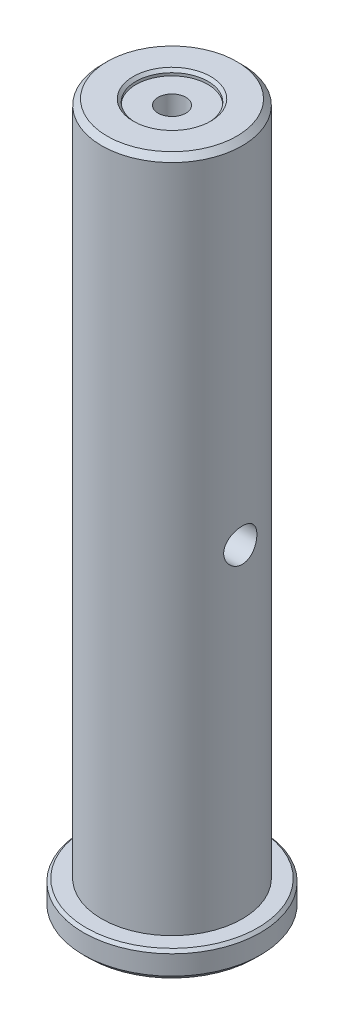
ISO-10303-21;
HEADER;
FILE_DESCRIPTION(('STEP AP214'),'2;1');
FILE_NAME('part.step','',(''),(''),'','','');
FILE_SCHEMA(('AUTOMOTIVE_DESIGN { 1 0 10303 214 1 1 1 1 }'));
ENDSEC;
DATA;
#1=APPLICATION_CONTEXT('core data for automotive mechanical design processes');
#2=APPLICATION_PROTOCOL_DEFINITION('international standard','automotive_design',2000,#1);
#3=PRODUCT_CONTEXT('',#1,'mechanical');
#4=PRODUCT('Part','Part','',(#3));
#5=PRODUCT_RELATED_PRODUCT_CATEGORY('part','',(#4));
#6=PRODUCT_DEFINITION_FORMATION('','',#4);
#7=PRODUCT_DEFINITION_CONTEXT('part definition',#1,'design');
#8=PRODUCT_DEFINITION('design','',#6,#7);
#9=PRODUCT_DEFINITION_SHAPE('','',#8);
#10=(LENGTH_UNIT() NAMED_UNIT(*) SI_UNIT(.MILLI.,.METRE.));
#11=(NAMED_UNIT(*) PLANE_ANGLE_UNIT() SI_UNIT($,.RADIAN.));
#12=(NAMED_UNIT(*) SI_UNIT($,.STERADIAN.) SOLID_ANGLE_UNIT());
#13=UNCERTAINTY_MEASURE_WITH_UNIT(LENGTH_MEASURE(1.E-05),#10,'distance_accuracy_value','');
#14=(GEOMETRIC_REPRESENTATION_CONTEXT(3) GLOBAL_UNCERTAINTY_ASSIGNED_CONTEXT((#13)) GLOBAL_UNIT_ASSIGNED_CONTEXT((#10,
#11,#12)) REPRESENTATION_CONTEXT('',''));
#15=CARTESIAN_POINT('',(0.,0.,0.));
#16=DIRECTION('',(0.,0.,1.));
#17=DIRECTION('',(1.,0.,0.));
#18=AXIS2_PLACEMENT_3D('',#15,#16,#17);
#19=CARTESIAN_POINT('',(0.,-26.0999999998717,0.));
#20=DIRECTION('',(0.,-1.,0.));
#21=DIRECTION('',(0.,0.,-1.));
#22=AXIS2_PLACEMENT_3D('',#19,#20,#21);
#23=CONICAL_SURFACE('',#22,2.49999999988404,1.02974425862171);
#24=CARTESIAN_POINT('',(0.,-24.5978484523448,5.6843418860808E-11));
#25=VERTEX_POINT('',#24);
#26=VERTEX_LOOP('',#25);
#27=FACE_BOUND('',#26,.T.);
#28=CARTESIAN_POINT('',(0.,-26.1,0.));
#29=DIRECTION('',(0.,-1.,0.));
#30=DIRECTION('',(0.,0.,-1.));
#31=AXIS2_PLACEMENT_3D('',#28,#29,#30);
#32=CIRCLE('',#31,2.5);
#33=CARTESIAN_POINT('',(0.,-26.1,-2.5));
#34=VERTEX_POINT('',#33);
#35=EDGE_CURVE('E70',#34,#34,#32,.T.);
#36=ORIENTED_EDGE('',*,*,#35,.T.);
#37=EDGE_LOOP('',(#36));
#38=FACE_BOUND('',#37,.T.);
#39=ADVANCED_FACE('F37',(#27,#38),#23,.F.);
#40=CARTESIAN_POINT('',(0.,-37.1,0.));
#41=DIRECTION('',(0.,-1.,0.));
#42=DIRECTION('',(0.,0.,-1.));
#43=AXIS2_PLACEMENT_3D('',#40,#41,#42);
#44=CYLINDRICAL_SURFACE('',#43,2.5);
#45=CARTESIAN_POINT('',(0.,-37.1,0.));
#46=DIRECTION('',(0.,-1.,0.));
#47=DIRECTION('',(0.,0.,-1.));
#48=AXIS2_PLACEMENT_3D('',#45,#46,#47);
#49=CIRCLE('',#48,2.5);
#50=CARTESIAN_POINT('',(0.,-37.1,-2.5));
#51=VERTEX_POINT('',#50);
#52=EDGE_CURVE('E96',#51,#51,#49,.T.);
#53=ORIENTED_EDGE('',*,*,#52,.T.);
#54=EDGE_LOOP('',(#53));
#55=FACE_BOUND('',#54,.T.);
#56=ORIENTED_EDGE('',*,*,#35,.F.);
#57=EDGE_LOOP('',(#56));
#58=FACE_BOUND('',#57,.T.);
#59=ADVANCED_FACE('F155',(#55,#58),#44,.F.);
#60=CARTESIAN_POINT('',(0.,-37.1,0.));
#61=DIRECTION('',(0.,1.,0.));
#62=DIRECTION('',(0.,0.,1.));
#63=AXIS2_PLACEMENT_3D('',#60,#61,#62);
#64=PLANE('',#63);
#65=CARTESIAN_POINT('',(0.,-37.1,0.));
#66=DIRECTION('',(0.,-1.,0.));
#67=DIRECTION('',(0.,0.,-1.));
#68=AXIS2_PLACEMENT_3D('',#65,#66,#67);
#69=CIRCLE('',#68,9.00000000000001);
#70=CARTESIAN_POINT('',(0.,-37.1,-9.00000000000001));
#71=VERTEX_POINT('',#70);
#72=EDGE_CURVE('E91',#71,#71,#69,.T.);
#73=ORIENTED_EDGE('',*,*,#72,.T.);
#74=EDGE_LOOP('',(#73));
#75=FACE_BOUND('',#74,.T.);
#76=ORIENTED_EDGE('',*,*,#52,.F.);
#77=EDGE_LOOP('',(#76));
#78=FACE_BOUND('',#77,.T.);
#79=ADVANCED_FACE('F162',(#75,#78),#64,.F.);
#80=CARTESIAN_POINT('',(0.,-37.6,0.));
#81=DIRECTION('',(0.,-1.,0.));
#82=DIRECTION('',(0.,0.,-1.));
#83=AXIS2_PLACEMENT_3D('',#80,#81,#82);
#84=CONICAL_SURFACE('',#83,9.50000000000001,0.78539816339745);
#85=ORIENTED_EDGE('',*,*,#72,.F.);
#86=EDGE_LOOP('',(#85));
#87=FACE_BOUND('',#86,.T.);
#88=CARTESIAN_POINT('',(0.,-37.6,0.));
#89=DIRECTION('',(0.,1.,0.));
#90=DIRECTION('',(0.,0.,1.));
#91=AXIS2_PLACEMENT_3D('',#88,#89,#90);
#92=CIRCLE('',#91,9.50000000000001);
#93=CARTESIAN_POINT('',(0.,-37.6,9.50000000000001));
#94=VERTEX_POINT('',#93);
#95=EDGE_CURVE('E87',#94,#94,#92,.F.);
#96=ORIENTED_EDGE('',*,*,#95,.T.);
#97=EDGE_LOOP('',(#96));
#98=FACE_BOUND('',#97,.T.);
#99=ADVANCED_FACE('F169',(#87,#98),#84,.F.);
#100=CARTESIAN_POINT('',(0.,26.5038387670979,0.));
#101=DIRECTION('',(0.,1.,0.));
#102=DIRECTION('',(0.,0.,1.));
#103=AXIS2_PLACEMENT_3D('',#100,#101,#102);
#104=CYLINDRICAL_SURFACE('',#103,9.50000000000001);
#105=ORIENTED_EDGE('',*,*,#95,.F.);
#106=EDGE_LOOP('',(#105));
#107=FACE_BOUND('',#106,.T.);
#108=CARTESIAN_POINT('',(0.,-38.1,0.));
#109=DIRECTION('',(0.,1.,0.));
#110=DIRECTION('',(0.,0.,1.));
#111=AXIS2_PLACEMENT_3D('',#108,#109,#110);
#112=CIRCLE('',#111,9.50000000000001);
#113=CARTESIAN_POINT('',(0.,-38.1,9.50000000000001));
#114=VERTEX_POINT('',#113);
#115=EDGE_CURVE('E90',#114,#114,#112,.F.);
#116=ORIENTED_EDGE('',*,*,#115,.T.);
#117=EDGE_LOOP('',(#116));
#118=FACE_BOUND('',#117,.T.);
#119=ADVANCED_FACE('F173',(#107,#118),#104,.F.);
#120=CARTESIAN_POINT('',(9.50000000000001,-38.1,0.));
#121=DIRECTION('',(0.,1.,0.));
#122=DIRECTION('',(0.,0.,1.));
#123=AXIS2_PLACEMENT_3D('',#120,#121,#122);
#124=PLANE('',#123);
#125=ORIENTED_EDGE('',*,*,#115,.F.);
#126=EDGE_LOOP('',(#125));
#127=FACE_BOUND('',#126,.T.);
#128=CARTESIAN_POINT('',(0.,-38.1,0.));
#129=DIRECTION('',(0.,1.,0.));
#130=DIRECTION('',(0.,0.,1.));
#131=AXIS2_PLACEMENT_3D('',#128,#129,#130);
#132=CIRCLE('',#131,15.);
#133=CARTESIAN_POINT('',(0.,-38.1,15.));
#134=VERTEX_POINT('',#133);
#135=EDGE_CURVE('E84',#134,#134,#132,.T.);
#136=ORIENTED_EDGE('',*,*,#135,.F.);
#137=EDGE_LOOP('',(#136));
#138=FACE_BOUND('',#137,.T.);
#139=ADVANCED_FACE('F176',(#127,#138),#124,.F.);
#140=CARTESIAN_POINT('',(0.,-37.1,0.));
#141=DIRECTION('',(0.,1.,0.));
#142=DIRECTION('',(0.,0.,1.));
#143=AXIS2_PLACEMENT_3D('',#140,#141,#142);
#144=CONICAL_SURFACE('',#143,16.,0.785398163397447);
#145=ORIENTED_EDGE('',*,*,#135,.T.);
#146=EDGE_LOOP('',(#145));
#147=FACE_BOUND('',#146,.T.);
#148=CARTESIAN_POINT('',(0.,-37.1,0.));
#149=DIRECTION('',(0.,1.,0.));
#150=DIRECTION('',(0.,0.,1.));
#151=AXIS2_PLACEMENT_3D('',#148,#149,#150);
#152=CIRCLE('',#151,16.);
#153=CARTESIAN_POINT('',(0.,-37.1,16.));
#154=VERTEX_POINT('',#153);
#155=EDGE_CURVE('E79',#154,#154,#152,.T.);
#156=ORIENTED_EDGE('',*,*,#155,.F.);
#157=EDGE_LOOP('',(#156));
#158=FACE_BOUND('',#157,.T.);
#159=ADVANCED_FACE('F180',(#147,#158),#144,.T.);
#160=CARTESIAN_POINT('',(0.,26.5038387670979,0.));
#161=DIRECTION('',(0.,1.,0.));
#162=DIRECTION('',(0.,0.,1.));
#163=AXIS2_PLACEMENT_3D('',#160,#161,#162);
#164=CYLINDRICAL_SURFACE('',#163,16.);
#165=ORIENTED_EDGE('',*,*,#155,.T.);
#166=EDGE_LOOP('',(#165));
#167=FACE_BOUND('',#166,.T.);
#168=CARTESIAN_POINT('',(0.,-33.6,0.));
#169=DIRECTION('',(0.,-1.,0.));
#170=DIRECTION('',(0.,0.,-1.));
#171=AXIS2_PLACEMENT_3D('',#168,#169,#170);
#172=CIRCLE('',#171,16.);
#173=CARTESIAN_POINT('',(0.,-33.6,-16.));
#174=VERTEX_POINT('',#173);
#175=EDGE_CURVE('E75',#174,#174,#172,.F.);
#176=ORIENTED_EDGE('',*,*,#175,.F.);
#177=EDGE_LOOP('',(#176));
#178=FACE_BOUND('',#177,.T.);
#179=ADVANCED_FACE('F184',(#167,#178),#164,.T.);
#180=CARTESIAN_POINT('',(0.,-33.6,0.));
#181=DIRECTION('',(0.,-1.,0.));
#182=DIRECTION('',(0.,0.,-1.));
#183=AXIS2_PLACEMENT_3D('',#180,#181,#182);
#184=CONICAL_SURFACE('',#183,16.,0.785398163397448);
#185=ORIENTED_EDGE('',*,*,#175,.T.);
#186=EDGE_LOOP('',(#185));
#187=FACE_BOUND('',#186,.T.);
#188=CARTESIAN_POINT('',(0.,-33.1,0.));
#189=DIRECTION('',(0.,-1.,0.));
#190=DIRECTION('',(0.,0.,-1.));
#191=AXIS2_PLACEMENT_3D('',#188,#189,#190);
#192=CIRCLE('',#191,15.5);
#193=CARTESIAN_POINT('',(0.,-33.1,-15.5));
#194=VERTEX_POINT('',#193);
#195=EDGE_CURVE('E78',#194,#194,#192,.T.);
#196=ORIENTED_EDGE('',*,*,#195,.T.);
#197=EDGE_LOOP('',(#196));
#198=FACE_BOUND('',#197,.T.);
#199=ADVANCED_FACE('F188',(#187,#198),#184,.T.);
#200=CARTESIAN_POINT('',(15.5,-33.1,0.));
#201=DIRECTION('',(0.,-1.,0.));
#202=DIRECTION('',(0.,0.,-1.));
#203=AXIS2_PLACEMENT_3D('',#200,#201,#202);
#204=PLANE('',#203);
#205=ORIENTED_EDGE('',*,*,#195,.F.);
#206=EDGE_LOOP('',(#205));
#207=FACE_BOUND('',#206,.T.);
#208=CARTESIAN_POINT('',(0.,-33.1,0.));
#209=DIRECTION('',(0.,1.,0.));
#210=DIRECTION('',(0.,0.,1.));
#211=AXIS2_PLACEMENT_3D('',#208,#209,#210);
#212=CIRCLE('',#211,12.7);
#213=CARTESIAN_POINT('',(0.,-33.1,12.7));
#214=VERTEX_POINT('',#213);
#215=EDGE_CURVE('E99',#214,#214,#212,.T.);
#216=ORIENTED_EDGE('',*,*,#215,.F.);
#217=EDGE_LOOP('',(#216));
#218=FACE_BOUND('',#217,.T.);
#219=ADVANCED_FACE('F151',(#207,#218),#204,.F.);
#220=CARTESIAN_POINT('',(0.,26.5038387670979,0.));
#221=DIRECTION('',(0.,1.,0.));
#222=DIRECTION('',(0.,0.,1.));
#223=AXIS2_PLACEMENT_3D('',#220,#221,#222);
#224=CYLINDRICAL_SURFACE('',#223,12.7);
#225=CARTESIAN_POINT('',(-12.3405834546021,25.4,-3.00000000000001));
#226=CARTESIAN_POINT('',(-12.3405867552515,25.2340309742241,-2.9999947986192));
#227=CARTESIAN_POINT('',(-12.3439681639376,25.0680022234936,-2.98618025270879));
#228=CARTESIAN_POINT('',(-12.3570983771738,24.7406913937602,-2.93136245477037));
#229=CARTESIAN_POINT('',(-12.3668512939366,24.5794124506168,-2.8903416433815));
#230=CARTESIAN_POINT('',(-12.3915597141969,24.2663829455557,-2.78249577795816));
#231=CARTESIAN_POINT('',(-12.406508961645,24.1146211837446,-2.71570174263797));
#232=CARTESIAN_POINT('',(-12.439917980932,23.8244468335215,-2.5582975169812));
#233=CARTESIAN_POINT('',(-12.4583778022552,23.6860344333204,-2.46768699092613));
#234=CARTESIAN_POINT('',(-12.4971341157553,23.4237648667291,-2.26332000863187));
#235=CARTESIAN_POINT('',(-12.5174573393053,23.3002087828986,-2.14918216282701));
#236=CARTESIAN_POINT('',(-12.5574177003081,23.0738045192715,-1.90182286693526));
#237=CARTESIAN_POINT('',(-12.5770547786081,22.9709581212415,-1.76859977652745));
#238=CARTESIAN_POINT('',(-12.6137239719163,22.7876793742958,-1.48480893314835));
#239=CARTESIAN_POINT('',(-12.6307208615053,22.7075400019444,-1.33404702472816));
#240=CARTESIAN_POINT('',(-12.6598909936041,22.5738507536394,-1.02072515323631));
#241=CARTESIAN_POINT('',(-12.6720648694535,22.5202973862805,-0.858166742555066));
#242=CARTESIAN_POINT('',(-12.6900283681532,22.4422568078228,-0.529001629765295));
#243=CARTESIAN_POINT('',(-12.6959299939122,22.4172590529449,-0.362522187479545));
#244=CARTESIAN_POINT('',(-12.7010733204737,22.3954396059966,-0.0276350287817193));
#245=CARTESIAN_POINT('',(-12.7003159043761,22.398614177807,0.140772428985132));
#246=CARTESIAN_POINT('',(-12.6923108785029,22.4326761149572,0.471204028849365));
#247=CARTESIAN_POINT('',(-12.685192248261,22.4630127677274,0.633288530270396));
#248=CARTESIAN_POINT('',(-12.6654133212508,22.5496560047824,0.949998324283782));
#249=CARTESIAN_POINT('',(-12.652752748352,22.6059638831058,1.10462324477203));
#250=CARTESIAN_POINT('',(-12.6231105369077,22.7434155280563,1.40351094180073));
#251=CARTESIAN_POINT('',(-12.6060939900068,22.8247610633708,1.54767732548809));
#252=CARTESIAN_POINT('',(-12.569594968861,23.0098271166194,1.82050994076874));
#253=CARTESIAN_POINT('',(-12.5501121075764,23.1135511482231,1.94917373333533));
#254=CARTESIAN_POINT('',(-12.5102557426675,23.3434035197155,2.19062975846301));
#255=CARTESIAN_POINT('',(-12.4898720962147,23.470013554354,2.30296222384418));
#256=CARTESIAN_POINT('',(-12.4509479008397,23.7404875791052,2.5048957074095));
#257=CARTESIAN_POINT('',(-12.4324074202314,23.8843522082947,2.59449588325036));
#258=CARTESIAN_POINT('',(-12.3992364452359,24.1860805887778,2.74867389435204));
#259=CARTESIAN_POINT('',(-12.3846216061614,24.3439971432482,2.81315199075165));
#260=CARTESIAN_POINT('',(-12.361163891032,24.6688543435126,2.91450898004239));
#261=CARTESIAN_POINT('',(-12.3523199281954,24.8357932837791,2.95139306967752));
#262=CARTESIAN_POINT('',(-12.3416305703028,25.1697211574721,2.99577506689081));
#263=CARTESIAN_POINT('',(-12.3396244346744,25.3366153291514,3.0039480461921));
#264=CARTESIAN_POINT('',(-12.3424021208832,25.6693819763325,2.99251467034554));
#265=CARTESIAN_POINT('',(-12.3471853912633,25.8352545337141,2.97291057134052));
#266=CARTESIAN_POINT('',(-12.3628499077692,26.1588346439623,2.90706871465484));
#267=CARTESIAN_POINT('',(-12.37364334047,26.3166248358406,2.86121423179316));
#268=CARTESIAN_POINT('',(-12.4000305578142,26.6222810505835,2.74459361459814));
#269=CARTESIAN_POINT('',(-12.4156248628205,26.7701459955406,2.67382477969691));
#270=CARTESIAN_POINT('',(-12.4502018670966,27.0546426079838,2.50793769135439));
#271=CARTESIAN_POINT('',(-12.4692397057665,27.1910288293784,2.41241023649746));
#272=CARTESIAN_POINT('',(-12.508418891342,27.4460832351942,2.20024312204814));
#273=CARTESIAN_POINT('',(-12.5285603989996,27.5647488291373,2.08360038123467));
#274=CARTESIAN_POINT('',(-12.5682154806913,27.7836757565837,1.8294351289871));
#275=CARTESIAN_POINT('',(-12.5877053868826,27.8834731277362,1.69150862917181));
#276=CARTESIAN_POINT('',(-12.6233979717533,28.0584849186101,1.40045958706062));
#277=CARTESIAN_POINT('',(-12.6396008155023,28.1337005728922,1.24733780841667));
#278=CARTESIAN_POINT('',(-12.6667953232137,28.2567989973915,0.931266340092585));
#279=CARTESIAN_POINT('',(-12.6778226529874,28.3048693146483,0.768392904306745));
#280=CARTESIAN_POINT('',(-12.6935789726756,28.372887097615,0.436588241550898));
#281=CARTESIAN_POINT('',(-12.6983090399519,28.3928393739101,0.267658055874661));
#282=CARTESIAN_POINT('',(-12.7008993537832,28.4038086341681,-0.0670858950952647));
#283=CARTESIAN_POINT('',(-12.698922999739,28.3955138298096,-0.232876206526183));
#284=CARTESIAN_POINT('',(-12.6886792846242,28.3517838547065,-0.560628835557882));
#285=CARTESIAN_POINT('',(-12.6804120752351,28.3163493383389,-0.722591245357753));
#286=CARTESIAN_POINT('',(-12.6585349476798,28.219697769664,-1.03745535327697));
#287=CARTESIAN_POINT('',(-12.6449483253229,28.158593053244,-1.19039325739078));
#288=CARTESIAN_POINT('',(-12.6138718519278,28.0124400630194,-1.48392969727621));
#289=CARTESIAN_POINT('',(-12.5963815576374,27.927389069888,-1.62452682925617));
#290=CARTESIAN_POINT('',(-12.5589188788385,27.7335926487413,-1.89269784116764));
#291=CARTESIAN_POINT('',(-12.538900801949,27.624372322815,-2.01992216623952));
#292=CARTESIAN_POINT('',(-12.498861896439,27.3862761933158,-2.2544712498921));
#293=CARTESIAN_POINT('',(-12.4788410683609,27.257395538937,-2.36179108290443));
#294=CARTESIAN_POINT('',(-12.4406982518011,26.9811279693928,-2.55517580989632));
#295=CARTESIAN_POINT('',(-12.4226122154044,26.8334754329365,-2.64086882423843));
#296=CARTESIAN_POINT('',(-12.3908548561017,26.5254595481595,-2.78608721227338));
#297=CARTESIAN_POINT('',(-12.377180079871,26.3651062656254,-2.84563306834565));
#298=CARTESIAN_POINT('',(-12.3581116997091,26.0706830677178,-2.92718665623947));
#299=CARTESIAN_POINT('',(-12.3515853338036,25.9381136225664,-2.95443550510606));
#300=CARTESIAN_POINT('',(-12.3428200100531,25.6703758812206,-2.99084369124859));
#301=CARTESIAN_POINT('',(-12.3405807657064,25.5352077593017,-3.00000423733911));
#302=CARTESIAN_POINT('',(-12.3405834546021,25.4,-3.00000000000001));
#303=B_SPLINE_CURVE_WITH_KNOTS('',3,(#225,#226,#227,#228,#229,#230,#231,#232,#233,#234,#235,
#236,#237,#238,#239,#240,#241,#242,#243,#244,#245,#246,#247,#248,#249,#250,#251,#252,#253,#254,
#255,#256,#257,#258,#259,#260,#261,#262,#263,#264,#265,#266,#267,#268,#269,#270,#271,#272,#273,
#274,#275,#276,#277,#278,#279,#280,#281,#282,#283,#284,#285,#286,#287,#288,#289,#290,#291,#292,
#293,#294,#295,#296,#297,#298,#299,#300,#301,#302),.UNSPECIFIED.,.T.,.F.,(4,2,2,2,2,2,2,2,2,2,2,
2,2,2,2,2,2,2,2,2,2,2,2,2,2,2,2,2,2,2,2,2,2,2,2,2,2,2,4),(0.,0.497411026443941,
0.995143402777372,1.49227860492331,1.98942081508859,2.49536478555058,3.00135226653359,
3.51359835731242,4.02577715959639,4.52864792978655,5.03145201194261,5.52428694235285,
6.01714643133854,6.51408654761747,7.01110474580709,7.52015808792639,8.02923029022512,
8.54030348656796,9.05128040890335,9.55015944231039,10.048997957495,10.5407323472655,
11.0325200545446,11.5330211371553,12.0335953137055,12.5452167410731,13.0568124694697,
13.5648289273917,14.0727584605778,14.568402228839,15.0640340468005,15.5575191492549,
16.0510603142398,16.555330529637,17.0597253658004,17.5722788464447,18.0844300988553,
18.4896763485681,18.8948955153554),.UNSPECIFIED.);
#304=CARTESIAN_POINT('',(-12.3405834546021,25.4,-3.00000000000001));
#305=VERTEX_POINT('',#304);
#306=EDGE_CURVE('E41',#305,#305,#303,.T.);
#307=ORIENTED_EDGE('',*,*,#306,.F.);
#308=EDGE_LOOP('',(#307));
#309=FACE_BOUND('',#308,.T.);
#310=CARTESIAN_POINT('',(12.3405834546021,25.4,-3.00000000000001));
#311=CARTESIAN_POINT('',(12.3405867552515,25.5659690257759,-2.9999947986192));
#312=CARTESIAN_POINT('',(12.3439681639376,25.7319977765064,-2.98618025270879));
#313=CARTESIAN_POINT('',(12.3570983771738,26.0593086062398,-2.93136245477037));
#314=CARTESIAN_POINT('',(12.3668512939366,26.2205875493833,-2.8903416433815));
#315=CARTESIAN_POINT('',(12.3915597141969,26.5336170544443,-2.78249577795816));
#316=CARTESIAN_POINT('',(12.406508961645,26.6853788162555,-2.71570174263797));
#317=CARTESIAN_POINT('',(12.439917980932,26.9755531664785,-2.5582975169812));
#318=CARTESIAN_POINT('',(12.4583778022552,27.1139655666796,-2.46768699092613));
#319=CARTESIAN_POINT('',(12.4971341157553,27.3762351332709,-2.26332000863187));
#320=CARTESIAN_POINT('',(12.5174573393053,27.4997912171014,-2.14918216282701));
#321=CARTESIAN_POINT('',(12.5574177003081,27.7261954807285,-1.90182286693526));
#322=CARTESIAN_POINT('',(12.5770547786081,27.8290418787585,-1.76859977652745));
#323=CARTESIAN_POINT('',(12.6137239719163,28.0123206257042,-1.48480893314835));
#324=CARTESIAN_POINT('',(12.6307208615053,28.0924599980557,-1.33404702472816));
#325=CARTESIAN_POINT('',(12.6598909936041,28.2261492463606,-1.02072515323631));
#326=CARTESIAN_POINT('',(12.6720648694535,28.2797026137196,-0.858166742555066));
#327=CARTESIAN_POINT('',(12.6900283681532,28.3577431921772,-0.529001629765295));
#328=CARTESIAN_POINT('',(12.6959299939122,28.3827409470551,-0.362522187479545));
#329=CARTESIAN_POINT('',(12.7010733204737,28.4045603940034,-0.0276350287817193));
#330=CARTESIAN_POINT('',(12.7003159043761,28.4013858221931,0.140772428985132));
#331=CARTESIAN_POINT('',(12.6923108785029,28.3673238850428,0.471204028849365));
#332=CARTESIAN_POINT('',(12.685192248261,28.3369872322726,0.633288530270397));
#333=CARTESIAN_POINT('',(12.6654133212508,28.2503439952176,0.949998324283783));
#334=CARTESIAN_POINT('',(12.652752748352,28.1940361168942,1.10462324477204));
#335=CARTESIAN_POINT('',(12.6231105369077,28.0565844719438,1.40351094180073));
#336=CARTESIAN_POINT('',(12.6060939900068,27.9752389366292,1.54767732548809));
#337=CARTESIAN_POINT('',(12.569594968861,27.7901728833806,1.82050994076874));
#338=CARTESIAN_POINT('',(12.5501121075764,27.6864488517769,1.94917373333533));
#339=CARTESIAN_POINT('',(12.5102557426675,27.4565964802845,2.19062975846301));
#340=CARTESIAN_POINT('',(12.4898720962147,27.329986445646,2.30296222384418));
#341=CARTESIAN_POINT('',(12.4509479008397,27.0595124208948,2.5048957074095));
#342=CARTESIAN_POINT('',(12.4324074202314,26.9156477917053,2.59449588325036));
#343=CARTESIAN_POINT('',(12.3992364452359,26.6139194112222,2.74867389435204));
#344=CARTESIAN_POINT('',(12.3846216061614,26.4560028567518,2.81315199075165));
#345=CARTESIAN_POINT('',(12.361163891032,26.1311456564874,2.91450898004239));
#346=CARTESIAN_POINT('',(12.3523199281954,25.9642067162209,2.95139306967752));
#347=CARTESIAN_POINT('',(12.3416305703028,25.6302788425279,2.99577506689081));
#348=CARTESIAN_POINT('',(12.3396244346744,25.4633846708486,3.0039480461921));
#349=CARTESIAN_POINT('',(12.3424021208832,25.1306180236675,2.99251467034554));
#350=CARTESIAN_POINT('',(12.3471853912633,24.9647454662859,2.97291057134052));
#351=CARTESIAN_POINT('',(12.3628499077692,24.6411653560378,2.90706871465484));
#352=CARTESIAN_POINT('',(12.37364334047,24.4833751641594,2.86121423179317));
#353=CARTESIAN_POINT('',(12.4000305578142,24.1777189494165,2.74459361459814));
#354=CARTESIAN_POINT('',(12.4156248628205,24.0298540044594,2.67382477969691));
#355=CARTESIAN_POINT('',(12.4502018670966,23.7453573920163,2.50793769135439));
#356=CARTESIAN_POINT('',(12.4692397057665,23.6089711706216,2.41241023649746));
#357=CARTESIAN_POINT('',(12.508418891342,23.3539167648058,2.20024312204814));
#358=CARTESIAN_POINT('',(12.5285603989996,23.2352511708627,2.08360038123467));
#359=CARTESIAN_POINT('',(12.5682154806913,23.0163242434163,1.8294351289871));
#360=CARTESIAN_POINT('',(12.5877053868826,22.9165268722638,1.69150862917181));
#361=CARTESIAN_POINT('',(12.6233979717533,22.7415150813899,1.40045958706062));
#362=CARTESIAN_POINT('',(12.6396008155023,22.6662994271078,1.24733780841667));
#363=CARTESIAN_POINT('',(12.6667953232137,22.5432010026085,0.931266340092585));
#364=CARTESIAN_POINT('',(12.6778226529874,22.4951306853517,0.768392904306745));
#365=CARTESIAN_POINT('',(12.6935789726756,22.427112902385,0.436588241550898));
#366=CARTESIAN_POINT('',(12.6983090399519,22.40716062609,0.267658055874661));
#367=CARTESIAN_POINT('',(12.7008993537832,22.3961913658319,-0.0670858950952647));
#368=CARTESIAN_POINT('',(12.698922999739,22.4044861701904,-0.232876206526183));
#369=CARTESIAN_POINT('',(12.6886792846242,22.4482161452935,-0.560628835557882));
#370=CARTESIAN_POINT('',(12.6804120752351,22.4836506616611,-0.722591245357753));
#371=CARTESIAN_POINT('',(12.6585349476798,22.580302230336,-1.03745535327697));
#372=CARTESIAN_POINT('',(12.6449483253229,22.641406946756,-1.19039325739078));
#373=CARTESIAN_POINT('',(12.6138718519278,22.7875599369806,-1.48392969727621));
#374=CARTESIAN_POINT('',(12.5963815576374,22.872610930112,-1.62452682925617));
#375=CARTESIAN_POINT('',(12.5589188788385,23.0664073512587,-1.89269784116764));
#376=CARTESIAN_POINT('',(12.538900801949,23.175627677185,-2.01992216623952));
#377=CARTESIAN_POINT('',(12.498861896439,23.4137238066842,-2.2544712498921));
#378=CARTESIAN_POINT('',(12.4788410683609,23.542604461063,-2.36179108290443));
#379=CARTESIAN_POINT('',(12.4406982518011,23.8188720306072,-2.55517580989632));
#380=CARTESIAN_POINT('',(12.4226122154044,23.9665245670635,-2.64086882423843));
#381=CARTESIAN_POINT('',(12.3908548561017,24.2745404518405,-2.78608721227338));
#382=CARTESIAN_POINT('',(12.377180079871,24.4348937343746,-2.84563306834565));
#383=CARTESIAN_POINT('',(12.3581116997091,24.7293169322822,-2.92718665623947));
#384=CARTESIAN_POINT('',(12.3515853338036,24.8618863774336,-2.95443550510605));
#385=CARTESIAN_POINT('',(12.3428200100531,25.1296241187794,-2.99084369124859));
#386=CARTESIAN_POINT('',(12.3405807657064,25.2647922406983,-3.00000423733911));
#387=CARTESIAN_POINT('',(12.3405834546021,25.4,-3.00000000000001));
#388=B_SPLINE_CURVE_WITH_KNOTS('',3,(#310,#311,#312,#313,#314,#315,#316,#317,#318,#319,#320,
#321,#322,#323,#324,#325,#326,#327,#328,#329,#330,#331,#332,#333,#334,#335,#336,#337,#338,#339,
#340,#341,#342,#343,#344,#345,#346,#347,#348,#349,#350,#351,#352,#353,#354,#355,#356,#357,#358,
#359,#360,#361,#362,#363,#364,#365,#366,#367,#368,#369,#370,#371,#372,#373,#374,#375,#376,#377,
#378,#379,#380,#381,#382,#383,#384,#385,#386,#387),.UNSPECIFIED.,.T.,.F.,(4,2,2,2,2,2,2,2,2,2,2,
2,2,2,2,2,2,2,2,2,2,2,2,2,2,2,2,2,2,2,2,2,2,2,2,2,2,2,4),(0.,0.497411026443941,
0.995143402777372,1.4922786049233,1.98942081508859,2.49536478555058,3.00135226653359,
3.51359835731242,4.02577715959639,4.52864792978655,5.03145201194261,5.52428694235286,
6.01714643133854,6.51408654761747,7.01110474580709,7.52015808792639,8.02923029022512,
8.54030348656797,9.05128040890335,9.55015944231039,10.048997957495,10.5407323472655,
11.0325200545446,11.5330211371553,12.0335953137055,12.5452167410731,13.0568124694697,
13.5648289273917,14.0727584605778,14.568402228839,15.0640340468005,15.5575191492549,
16.0510603142398,16.555330529637,17.0597253658004,17.5722788464447,18.0844300988553,
18.4896763485681,18.8948955153554),.UNSPECIFIED.);
#389=CARTESIAN_POINT('',(12.3405834546021,25.4,-3.00000000000001));
#390=VERTEX_POINT('',#389);
#391=EDGE_CURVE('E119',#390,#390,#388,.T.);
#392=ORIENTED_EDGE('',*,*,#391,.F.);
#393=EDGE_LOOP('',(#392));
#394=FACE_BOUND('',#393,.T.);
#395=CARTESIAN_POINT('',(0.,87.9,0.));
#396=DIRECTION('',(0.,1.,0.));
#397=DIRECTION('',(0.,0.,1.));
#398=AXIS2_PLACEMENT_3D('',#395,#396,#397);
#399=CIRCLE('',#398,12.7);
#400=CARTESIAN_POINT('',(0.,87.9,12.7));
#401=VERTEX_POINT('',#400);
#402=EDGE_CURVE('E115',#401,#401,#399,.F.);
#403=ORIENTED_EDGE('',*,*,#402,.T.);
#404=EDGE_LOOP('',(#403));
#405=FACE_BOUND('',#404,.T.);
#406=ORIENTED_EDGE('',*,*,#215,.T.);
#407=EDGE_LOOP('',(#406));
#408=FACE_BOUND('',#407,.T.);
#409=ADVANCED_FACE('F123',(#309,#394,#405,#408),#224,.T.);
#410=CARTESIAN_POINT('',(0.,88.9,0.));
#411=DIRECTION('',(0.,1.,0.));
#412=DIRECTION('',(0.,0.,1.));
#413=AXIS2_PLACEMENT_3D('',#410,#411,#412);
#414=PLANE('',#413);
#415=CARTESIAN_POINT('',(0.,88.9,0.));
#416=DIRECTION('',(0.,1.,0.));
#417=DIRECTION('',(0.,0.,1.));
#418=AXIS2_PLACEMENT_3D('',#415,#416,#417);
#419=CIRCLE('',#418,7.00000000000002);
#420=CARTESIAN_POINT('',(0.,88.9,7.00000000000002));
#421=VERTEX_POINT('',#420);
#422=EDGE_CURVE('E11',#421,#421,#419,.F.);
#423=ORIENTED_EDGE('',*,*,#422,.T.);
#424=EDGE_LOOP('',(#423));
#425=FACE_BOUND('',#424,.T.);
#426=CARTESIAN_POINT('',(0.,88.9,0.));
#427=DIRECTION('',(0.,1.,0.));
#428=DIRECTION('',(0.,0.,1.));
#429=AXIS2_PLACEMENT_3D('',#426,#427,#428);
#430=CIRCLE('',#429,11.7);
#431=CARTESIAN_POINT('',(0.,88.9,11.7));
#432=VERTEX_POINT('',#431);
#433=EDGE_CURVE('E102',#432,#432,#430,.T.);
#434=ORIENTED_EDGE('',*,*,#433,.T.);
#435=EDGE_LOOP('',(#434));
#436=FACE_BOUND('',#435,.T.);
#437=ADVANCED_FACE('F143',(#425,#436),#414,.T.);
#438=CARTESIAN_POINT('',(0.,88.9,0.));
#439=DIRECTION('',(0.,-1.,0.));
#440=DIRECTION('',(0.,0.,-1.));
#441=AXIS2_PLACEMENT_3D('',#438,#439,#440);
#442=CONICAL_SURFACE('',#441,11.7,0.785398163397451);
#443=ORIENTED_EDGE('',*,*,#402,.F.);
#444=EDGE_LOOP('',(#443));
#445=FACE_BOUND('',#444,.T.);
#446=ORIENTED_EDGE('',*,*,#433,.F.);
#447=EDGE_LOOP('',(#446));
#448=FACE_BOUND('',#447,.T.);
#449=ADVANCED_FACE('F141',(#445,#448),#442,.T.);
#450=CARTESIAN_POINT('',(0.,87.9,0.));
#451=DIRECTION('',(0.,1.,0.));
#452=DIRECTION('',(0.,0.,1.));
#453=AXIS2_PLACEMENT_3D('',#450,#451,#452);
#454=CYLINDRICAL_SURFACE('',#453,6.5);
#455=CARTESIAN_POINT('',(0.,88.4,0.));
#456=DIRECTION('',(0.,1.,0.));
#457=DIRECTION('',(0.,0.,1.));
#458=AXIS2_PLACEMENT_3D('',#455,#456,#457);
#459=CIRCLE('',#458,6.5);
#460=CARTESIAN_POINT('',(0.,88.4,6.5));
#461=VERTEX_POINT('',#460);
#462=EDGE_CURVE('E50',#461,#461,#459,.T.);
#463=ORIENTED_EDGE('',*,*,#462,.T.);
#464=EDGE_LOOP('',(#463));
#465=FACE_BOUND('',#464,.T.);
#466=CARTESIAN_POINT('',(0.,87.9,0.));
#467=DIRECTION('',(0.,1.,0.));
#468=DIRECTION('',(0.,0.,1.));
#469=AXIS2_PLACEMENT_3D('',#466,#467,#468);
#470=CIRCLE('',#469,6.5);
#471=CARTESIAN_POINT('',(0.,87.9,6.5));
#472=VERTEX_POINT('',#471);
#473=EDGE_CURVE('E66',#472,#472,#470,.T.);
#474=ORIENTED_EDGE('',*,*,#473,.F.);
#475=EDGE_LOOP('',(#474));
#476=FACE_BOUND('',#475,.T.);
#477=ADVANCED_FACE('F138',(#465,#476),#454,.F.);
#478=CARTESIAN_POINT('',(0.,87.9,0.));
#479=DIRECTION('',(0.,1.,0.));
#480=DIRECTION('',(0.,0.,1.));
#481=AXIS2_PLACEMENT_3D('',#478,#479,#480);
#482=PLANE('',#481);
#483=CARTESIAN_POINT('',(0.,87.9,0.));
#484=DIRECTION('',(0.,1.,0.));
#485=DIRECTION('',(0.,0.,1.));
#486=AXIS2_PLACEMENT_3D('',#483,#484,#485);
#487=CIRCLE('',#486,2.5);
#488=CARTESIAN_POINT('',(0.,87.9,2.5));
#489=VERTEX_POINT('',#488);
#490=EDGE_CURVE('E67',#489,#489,#487,.T.);
#491=ORIENTED_EDGE('',*,*,#490,.F.);
#492=EDGE_LOOP('',(#491));
#493=FACE_BOUND('',#492,.T.);
#494=ORIENTED_EDGE('',*,*,#473,.T.);
#495=EDGE_LOOP('',(#494));
#496=FACE_BOUND('',#495,.T.);
#497=ADVANCED_FACE('F135',(#493,#496),#482,.T.);
#498=CARTESIAN_POINT('',(0.,88.4,0.));
#499=DIRECTION('',(0.,1.,0.));
#500=DIRECTION('',(0.,0.,1.));
#501=AXIS2_PLACEMENT_3D('',#498,#499,#500);
#502=CONICAL_SURFACE('',#501,6.5,0.78539816339744);
#503=ORIENTED_EDGE('',*,*,#422,.F.);
#504=EDGE_LOOP('',(#503));
#505=FACE_BOUND('',#504,.T.);
#506=ORIENTED_EDGE('',*,*,#462,.F.);
#507=EDGE_LOOP('',(#506));
#508=FACE_BOUND('',#507,.T.);
#509=ADVANCED_FACE('F39',(#505,#508),#502,.F.);
#510=CARTESIAN_POINT('',(0.,76.9,0.));
#511=DIRECTION('',(0.,1.,0.));
#512=DIRECTION('',(0.,0.,1.));
#513=AXIS2_PLACEMENT_3D('',#510,#511,#512);
#514=CONICAL_SURFACE('',#513,2.5,1.02974425867665);
#515=CARTESIAN_POINT('',(0.,75.3978484524311,0.));
#516=VERTEX_POINT('',#515);
#517=VERTEX_LOOP('',#516);
#518=FACE_BOUND('',#517,.T.);
#519=CARTESIAN_POINT('',(0.,76.9,0.));
#520=DIRECTION('',(0.,1.,0.));
#521=DIRECTION('',(0.,0.,1.));
#522=AXIS2_PLACEMENT_3D('',#519,#520,#521);
#523=CIRCLE('',#522,2.5);
#524=CARTESIAN_POINT('',(0.,76.9,2.5));
#525=VERTEX_POINT('',#524);
#526=EDGE_CURVE('E64',#525,#525,#523,.T.);
#527=ORIENTED_EDGE('',*,*,#526,.T.);
#528=EDGE_LOOP('',(#527));
#529=FACE_BOUND('',#528,.T.);
#530=ADVANCED_FACE('F57',(#518,#529),#514,.F.);
#531=CARTESIAN_POINT('',(0.,87.9,0.));
#532=DIRECTION('',(0.,1.,0.));
#533=DIRECTION('',(0.,0.,1.));
#534=AXIS2_PLACEMENT_3D('',#531,#532,#533);
#535=CYLINDRICAL_SURFACE('',#534,2.5);
#536=ORIENTED_EDGE('',*,*,#526,.F.);
#537=EDGE_LOOP('',(#536));
#538=FACE_BOUND('',#537,.T.);
#539=ORIENTED_EDGE('',*,*,#490,.T.);
#540=EDGE_LOOP('',(#539));
#541=FACE_BOUND('',#540,.T.);
#542=ADVANCED_FACE('F60',(#538,#541),#535,.F.);
#543=CARTESIAN_POINT('',(-15.,25.4,0.));
#544=DIRECTION('',(1.,0.,0.));
#545=DIRECTION('',(0.,0.,-1.));
#546=AXIS2_PLACEMENT_3D('',#543,#544,#545);
#547=CYLINDRICAL_SURFACE('',#546,3.);
#548=ORIENTED_EDGE('',*,*,#306,.T.);
#549=EDGE_LOOP('',(#548));
#550=FACE_BOUND('',#549,.T.);
#551=ORIENTED_EDGE('',*,*,#391,.T.);
#552=EDGE_LOOP('',(#551));
#553=FACE_BOUND('',#552,.T.);
#554=ADVANCED_FACE('F127',(#550,#553),#547,.F.);
#555=CLOSED_SHELL('',(#39,#59,#79,#99,#119,#139,#159,#179,#199,#219,#409,#437,#449,#477,#497,
#509,#530,#542,#554));
#556=MANIFOLD_SOLID_BREP('B2',#555);
#557=ADVANCED_BREP_SHAPE_REPRESENTATION('',(#18,#556),#14);
#558=SHAPE_DEFINITION_REPRESENTATION(#9,#557);
ENDSEC;
END-ISO-10303-21;
